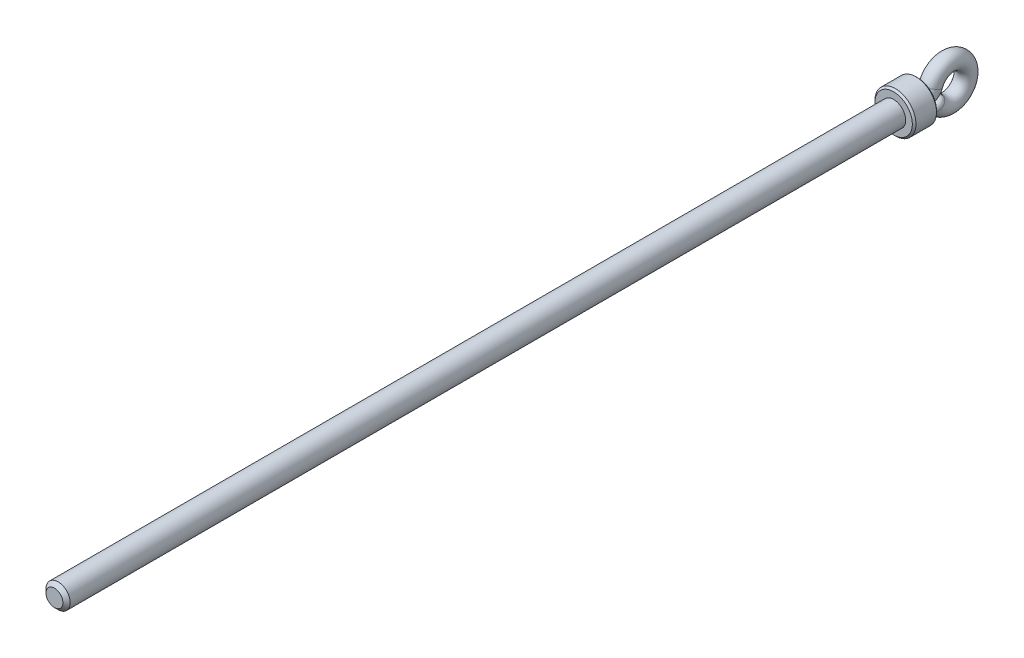
ISO-10303-21;
HEADER;
FILE_DESCRIPTION(('STEP AP214'),'2;1');
FILE_NAME('part.step','',(''),(''),'','','');
FILE_SCHEMA(('AUTOMOTIVE_DESIGN { 1 0 10303 214 1 1 1 1 }'));
ENDSEC;
DATA;
#1=APPLICATION_CONTEXT('core data for automotive mechanical design processes');
#2=APPLICATION_PROTOCOL_DEFINITION('international standard','automotive_design',2000,#1);
#3=PRODUCT_CONTEXT('',#1,'mechanical');
#4=PRODUCT('Part','Part','',(#3));
#5=PRODUCT_RELATED_PRODUCT_CATEGORY('part','',(#4));
#6=PRODUCT_DEFINITION_FORMATION('','',#4);
#7=PRODUCT_DEFINITION_CONTEXT('part definition',#1,'design');
#8=PRODUCT_DEFINITION('design','',#6,#7);
#9=PRODUCT_DEFINITION_SHAPE('','',#8);
#10=(LENGTH_UNIT() NAMED_UNIT(*) SI_UNIT(.MILLI.,.METRE.));
#11=(NAMED_UNIT(*) PLANE_ANGLE_UNIT() SI_UNIT($,.RADIAN.));
#12=(NAMED_UNIT(*) SI_UNIT($,.STERADIAN.) SOLID_ANGLE_UNIT());
#13=UNCERTAINTY_MEASURE_WITH_UNIT(LENGTH_MEASURE(1.E-05),#10,'distance_accuracy_value','');
#14=(GEOMETRIC_REPRESENTATION_CONTEXT(3) GLOBAL_UNCERTAINTY_ASSIGNED_CONTEXT((#13)) GLOBAL_UNIT_ASSIGNED_CONTEXT((#10,
#11,#12)) REPRESENTATION_CONTEXT('',''));
#15=CARTESIAN_POINT('',(0.,0.,0.));
#16=DIRECTION('',(0.,0.,1.));
#17=DIRECTION('',(1.,0.,0.));
#18=AXIS2_PLACEMENT_3D('',#15,#16,#17);
#19=CARTESIAN_POINT('',(0.,0.,695.));
#20=DIRECTION('',(0.,0.,-1.));
#21=DIRECTION('',(-1.,0.,0.));
#22=AXIS2_PLACEMENT_3D('',#19,#20,#21);
#23=CYLINDRICAL_SURFACE('',#22,10.);
#24=CARTESIAN_POINT('',(0.,0.,692.));
#25=DIRECTION('',(0.,0.,1.));
#26=DIRECTION('',(1.,0.,0.));
#27=AXIS2_PLACEMENT_3D('',#24,#25,#26);
#28=CIRCLE('',#27,10.);
#29=CARTESIAN_POINT('',(10.,0.,692.));
#30=VERTEX_POINT('',#29);
#31=EDGE_CURVE('E33',#30,#30,#28,.F.);
#32=ORIENTED_EDGE('',*,*,#31,.T.);
#33=EDGE_LOOP('',(#32));
#34=FACE_BOUND('',#33,.T.);
#35=CARTESIAN_POINT('',(0.,0.,0.));
#36=DIRECTION('',(0.,0.,1.));
#37=DIRECTION('',(1.,0.,0.));
#38=AXIS2_PLACEMENT_3D('',#35,#36,#37);
#39=CIRCLE('',#38,10.);
#40=CARTESIAN_POINT('',(10.,0.,0.));
#41=VERTEX_POINT('',#40);
#42=EDGE_CURVE('E142',#41,#41,#39,.T.);
#43=ORIENTED_EDGE('',*,*,#42,.T.);
#44=EDGE_LOOP('',(#43));
#45=FACE_BOUND('',#44,.T.);
#46=ADVANCED_FACE('F14',(#34,#45),#23,.T.);
#47=CARTESIAN_POINT('',(0.,0.,695.));
#48=DIRECTION('',(0.,0.,1.));
#49=DIRECTION('',(1.,0.,0.));
#50=AXIS2_PLACEMENT_3D('',#47,#48,#49);
#51=PLANE('',#50);
#52=CARTESIAN_POINT('',(0.,0.,695.));
#53=DIRECTION('',(0.,0.,1.));
#54=DIRECTION('',(1.,0.,0.));
#55=AXIS2_PLACEMENT_3D('',#52,#53,#54);
#56=CIRCLE('',#55,7.00000000000001);
#57=CARTESIAN_POINT('',(7.00000000000001,0.,695.));
#58=VERTEX_POINT('',#57);
#59=EDGE_CURVE('E113',#58,#58,#56,.T.);
#60=ORIENTED_EDGE('',*,*,#59,.T.);
#61=EDGE_LOOP('',(#60));
#62=FACE_BOUND('',#61,.T.);
#63=ADVANCED_FACE('F82',(#62),#51,.T.);
#64=CARTESIAN_POINT('',(0.,0.,-20.));
#65=DIRECTION('',(0.,0.,1.));
#66=DIRECTION('',(1.,0.,0.));
#67=AXIS2_PLACEMENT_3D('',#64,#65,#66);
#68=CYLINDRICAL_SURFACE('',#67,17.);
#69=CARTESIAN_POINT('',(0.,0.,-1.49999999999995));
#70=DIRECTION('',(0.,0.,1.));
#71=DIRECTION('',(1.,0.,0.));
#72=AXIS2_PLACEMENT_3D('',#69,#70,#71);
#73=CIRCLE('',#72,17.);
#74=CARTESIAN_POINT('',(17.,0.,-1.49999999999995));
#75=VERTEX_POINT('',#74);
#76=EDGE_CURVE('E130',#75,#75,#73,.F.);
#77=ORIENTED_EDGE('',*,*,#76,.T.);
#78=EDGE_LOOP('',(#77));
#79=FACE_BOUND('',#78,.T.);
#80=CARTESIAN_POINT('',(0.,0.,-18.5000000000001));
#81=DIRECTION('',(0.,0.,1.));
#82=DIRECTION('',(1.,0.,0.));
#83=AXIS2_PLACEMENT_3D('',#80,#81,#82);
#84=CIRCLE('',#83,17.);
#85=CARTESIAN_POINT('',(17.,0.,-18.5000000000001));
#86=VERTEX_POINT('',#85);
#87=EDGE_CURVE('E134',#86,#86,#84,.T.);
#88=ORIENTED_EDGE('',*,*,#87,.T.);
#89=EDGE_LOOP('',(#88));
#90=FACE_BOUND('',#89,.T.);
#91=ADVANCED_FACE('F88',(#79,#90),#68,.T.);
#92=CARTESIAN_POINT('',(0.,0.,-20.));
#93=DIRECTION('',(0.,0.,1.));
#94=DIRECTION('',(1.,0.,0.));
#95=AXIS2_PLACEMENT_3D('',#92,#93,#94);
#96=PLANE('',#95);
#97=CARTESIAN_POINT('',(0.,0.,-20.));
#98=DIRECTION('',(0.,0.,1.));
#99=DIRECTION('',(1.,0.,0.));
#100=AXIS2_PLACEMENT_3D('',#97,#98,#99);
#101=CIRCLE('',#100,9.);
#102=CARTESIAN_POINT('',(9.,0.,-20.));
#103=VERTEX_POINT('',#102);
#104=EDGE_CURVE('E120',#103,#103,#101,.T.);
#105=ORIENTED_EDGE('',*,*,#104,.T.);
#106=EDGE_LOOP('',(#105));
#107=FACE_BOUND('',#106,.T.);
#108=CARTESIAN_POINT('',(0.,0.,-20.));
#109=DIRECTION('',(0.,0.,1.));
#110=DIRECTION('',(1.,0.,0.));
#111=AXIS2_PLACEMENT_3D('',#108,#109,#110);
#112=CIRCLE('',#111,15.5);
#113=CARTESIAN_POINT('',(15.5,0.,-20.));
#114=VERTEX_POINT('',#113);
#115=EDGE_CURVE('E126',#114,#114,#112,.F.);
#116=ORIENTED_EDGE('',*,*,#115,.T.);
#117=EDGE_LOOP('',(#116));
#118=FACE_BOUND('',#117,.T.);
#119=ADVANCED_FACE('F271',(#107,#118),#96,.F.);
#120=CARTESIAN_POINT('',(0.,0.,0.));
#121=DIRECTION('',(0.,0.,1.));
#122=DIRECTION('',(1.,0.,0.));
#123=AXIS2_PLACEMENT_3D('',#120,#121,#122);
#124=PLANE('',#123);
#125=CARTESIAN_POINT('',(0.,0.,0.));
#126=DIRECTION('',(0.,0.,1.));
#127=DIRECTION('',(1.,0.,0.));
#128=AXIS2_PLACEMENT_3D('',#125,#126,#127);
#129=CIRCLE('',#128,15.5000000000002);
#130=CARTESIAN_POINT('',(15.5000000000002,0.,0.));
#131=VERTEX_POINT('',#130);
#132=EDGE_CURVE('E138',#131,#131,#129,.T.);
#133=ORIENTED_EDGE('',*,*,#132,.T.);
#134=EDGE_LOOP('',(#133));
#135=FACE_BOUND('',#134,.T.);
#136=ORIENTED_EDGE('',*,*,#42,.F.);
#137=EDGE_LOOP('',(#136));
#138=FACE_BOUND('',#137,.T.);
#139=ADVANCED_FACE('F67',(#135,#138),#124,.T.);
#140=CARTESIAN_POINT('',(0.,-5.6190989012386,-31.0922421814982));
#141=DIRECTION('',(0.,-0.92718385456679,-0.374606593415906));
#142=DIRECTION('',(0.,0.374606593415906,-0.92718385456679));
#143=AXIS2_PLACEMENT_3D('',#140,#141,#142);
#144=PLANE('',#143);
#145=CARTESIAN_POINT('',(-0.267814899753251,-4.24294874486969,-34.4983333418537));
#146=CARTESIAN_POINT('',(-0.535964039163629,-3.18618303783898,-37.1139202504667));
#147=CARTESIAN_POINT('',(-0.624901432757596,-5.31433814850181,-38.9828767941055));
#148=CARTESIAN_POINT('',(-0.10669981189394,-4.23721080551919,-34.5125352401058));
#149=CARTESIAN_POINT('',(-0.213372702047782,-3.17709115436088,-37.1364234517361));
#150=CARTESIAN_POINT('',(-0.24896622772436,-5.29458411469505,-39.010392555168));
#151=CARTESIAN_POINT('',(0.0557192743773867,-4.23666309919185,-34.5138908608362));
#152=CARTESIAN_POINT('',(0.111416626490471,-3.17622472220716,-37.1385679465691));
#153=CARTESIAN_POINT('',(0.130011640243449,-5.29269527178391,-39.0130149226404));
#154=CARTESIAN_POINT('',(0.378406067436832,-4.2459646647267,-34.4908686782647));
#155=CARTESIAN_POINT('',(0.75758345158823,-3.1909667929823,-37.1020800410015));
#156=CARTESIAN_POINT('',(0.882947490699488,-5.32472333482806,-38.9684170545828));
#157=CARTESIAN_POINT('',(0.538674013800429,-4.25581276889777,-34.4664937650998));
#158=CARTESIAN_POINT('',(1.07983936736787,-3.20661368418201,-37.0633526262963));
#159=CARTESIAN_POINT('',(1.25690603219717,-5.35863621941736,-38.9212024169067));
#160=CARTESIAN_POINT('',(0.850088972014333,-4.28527806984585,-34.3935645860912));
#161=CARTESIAN_POINT('',(1.71070497526709,-3.25374810830347,-36.9466908328098));
#162=CARTESIAN_POINT('',(1.98354093470394,-5.45975590992779,-38.7795031073018));
#163=CARTESIAN_POINT('',(1.00133655074529,-4.30474694972162,-34.34537741746));
#164=CARTESIAN_POINT('',(2.02022082468757,-3.28511609734602,-36.8690523355125));
#165=CARTESIAN_POINT('',(2.33645195176725,-5.52645716066193,-38.6857360033921));
#166=CARTESIAN_POINT('',(1.29332499429876,-4.35265493436786,-34.2268009944884));
#167=CARTESIAN_POINT('',(2.62575498343679,-3.36316682901066,-36.6758699956699));
#168=CARTESIAN_POINT('',(3.0177583200599,-5.68980738952441,-38.4540301378224));
#169=CARTESIAN_POINT('',(1.43406464981001,-4.3810950696393,-34.1564091895687));
#170=CARTESIAN_POINT('',(2.92236085455471,-3.41003385837555,-36.5598700274302));
#171=CARTESIAN_POINT('',(3.34615084956294,-5.78645980803033,-38.3160863016868));
#172=CARTESIAN_POINT('',(1.70559193340705,-4.44694228423316,-33.9934316143933));
#173=CARTESIAN_POINT('',(3.50581556944884,-3.52019578102394,-36.2872097009361));
#174=CARTESIAN_POINT('',(3.97971451127664,-6.00891158281849,-37.9950991149901));
#175=CARTESIAN_POINT('',(1.8359668712502,-4.48458778863466,-33.900255721359));
#176=CARTESIAN_POINT('',(3.79246172010584,-3.58416094446185,-36.1288903658342));
#177=CARTESIAN_POINT('',(4.28392269958881,-6.13548232047446,-37.8108522184167));
#178=CARTESIAN_POINT('',(2.07903816647017,-4.56717462556752,-33.6958461270012));
#179=CARTESIAN_POINT('',(4.34129872883696,-3.72715987201687,-35.7749556001902));
#180=CARTESIAN_POINT('',(4.85108905510651,-6.41121009640481,-37.4043532677781));
#181=CARTESIAN_POINT('',(2.19173041569785,-4.61211764858216,-33.5846082415849));
#182=CARTESIAN_POINT('',(4.60364524530678,-3.80646547441348,-35.5786673462961));
#183=CARTESIAN_POINT('',(5.1140376366307,-6.56037236750889,-37.182092407072));
#184=CARTESIAN_POINT('',(2.40231481600309,-4.71048518827116,-33.3411400372977));
#185=CARTESIAN_POINT('',(5.11142479367259,-3.98388725587503,-35.1395330274909));
#186=CARTESIAN_POINT('',(5.60540123733802,-6.88438053582401,-36.6927903523807));
#187=CARTESIAN_POINT('',(2.49915407592637,-4.76422609928737,-33.2081266149509));
#188=CARTESIAN_POINT('',(5.35503971113456,-4.08300472606897,-34.89420868007));
#189=CARTESIAN_POINT('',(5.83135951049494,-7.06015030018002,-36.4240392911957));
#190=CARTESIAN_POINT('',(2.6685229621291,-4.87683900319797,-32.9293998969567));
#191=CARTESIAN_POINT('',(5.8029016387366,-4.29594611758227,-34.3671602413872));
#192=CARTESIAN_POINT('',(6.22655357830282,-7.42544617922704,-35.857502136448));
#193=CARTESIAN_POINT('',(2.74104712599448,-4.935712145316,-32.7836837568811));
#194=CARTESIAN_POINT('',(6.00674674067439,-4.41005227440125,-34.0847375927508));
#195=CARTESIAN_POINT('',(6.39577662732095,-7.61497537337142,-35.5597095380411));
#196=CARTESIAN_POINT('',(2.86267410632611,-5.05958707808983,-32.4770825393047));
#197=CARTESIAN_POINT('',(6.37581947811972,-4.65663337946306,-33.4744279413114));
#198=CARTESIAN_POINT('',(6.67957291476036,-8.01050509923215,-34.9296020277957));
#199=CARTESIAN_POINT('',(2.91066484290466,-5.12474243781629,-32.3158173650161));
#200=CARTESIAN_POINT('',(6.53823980201785,-4.7898488931911,-33.1447079746119));
#201=CARTESIAN_POINT('',(6.79155130011042,-8.2168631059956,-34.5963623398276));
#202=CARTESIAN_POINT('',(2.97723912694888,-5.2571327776788,-31.9881397753031));
#203=CARTESIAN_POINT('',(6.80459024537531,-5.06828018911193,-32.4555663344986));
#204=CARTESIAN_POINT('',(6.94689129621408,-8.6327300545619,-33.9156505539856));
#205=CARTESIAN_POINT('',(2.99581930203228,-5.32436799540214,-31.8217267718295));
#206=CARTESIAN_POINT('',(6.90756393001704,-5.21365603767943,-32.0957484829051));
#207=CARTESIAN_POINT('',(6.99024503807571,-8.84223935492987,-33.5681768286418));
#208=CARTESIAN_POINT('',(3.00297095485652,-5.46003619821918,-31.4859361866104));
#209=CARTESIAN_POINT('',(7.04792453219719,-5.51541300187756,-31.3488737878915));
#210=CARTESIAN_POINT('',(7.00693222799816,-9.2617574972421,-32.863758346261));
#211=CARTESIAN_POINT('',(2.99110810652139,-5.52847252902018,-31.3165503239488));
#212=CARTESIAN_POINT('',(7.08320525408174,-5.67193252423053,-30.9614743758125));
#213=CARTESIAN_POINT('',(6.97925224854835,-9.47173038745556,-32.5067492305341));
#214=CARTESIAN_POINT('',(2.93647501381529,-5.66359719160117,-30.9821050480223));
#215=CARTESIAN_POINT('',(7.07764622811232,-5.98967234228318,-30.1750407293435));
#216=CARTESIAN_POINT('',(6.85177503223625,-9.88339870069763,-31.7989770209835));
#217=CARTESIAN_POINT('',(2.89370596052631,-5.73028559064137,-30.8170454682825));
#218=CARTESIAN_POINT('',(7.03563962131795,-6.15079719396175,-29.7762427271952));
#219=CARTESIAN_POINT('',(6.75198057456524,-10.0850944423994,-31.44821368699));
#220=CARTESIAN_POINT('',(2.77884994105621,-5.85907311491569,-30.4982851600671));
#221=CARTESIAN_POINT('',(6.87093161465208,-6.47018696868093,-28.9857252946722));
#222=CARTESIAN_POINT('',(6.483983195794,-10.4721971890889,-30.7685131820488));
#223=CARTESIAN_POINT('',(2.70714713847289,-5.92122023517829,-30.3444656397274));
#224=CARTESIAN_POINT('',(6.74822619668567,-6.62826029452503,-28.5944800839996));
#225=CARTESIAN_POINT('',(6.31667665642216,-10.6577803335356,-30.4393533096008));
#226=CARTESIAN_POINT('',(2.53613119994427,-6.03993497912505,-30.0506363376781));
#227=CARTESIAN_POINT('',(6.42064236153453,-6.93744162777071,-27.8292294307615));
#228=CARTESIAN_POINT('',(5.9176394665236,-11.0104370540509,-29.8088517089643));
#229=CARTESIAN_POINT('',(2.43682318052268,-6.09650363412717,-29.9106240033669));
#230=CARTESIAN_POINT('',(6.21498311331832,-7.08820123680677,-27.4560863044102));
#231=CARTESIAN_POINT('',(5.68592075455222,-11.177514052147,-29.5075048395134));
#232=CARTESIAN_POINT('',(2.21636936017603,-6.2007470634353,-29.6526124619314));
#233=CARTESIAN_POINT('',(5.73013766037578,-7.37181670926837,-26.7541133770951));
#234=CARTESIAN_POINT('',(5.17152850707809,-11.4840832244933,-28.9509792022461));
#235=CARTESIAN_POINT('',(2.09591453127465,-6.24862686251161,-29.5341058006934));
#236=CARTESIAN_POINT('',(5.45269078156246,-7.50469196855701,-26.4252355696854));
#237=CARTESIAN_POINT('',(4.89046723963124,-11.624217886761,-28.6947422138669));
#238=CARTESIAN_POINT('',(1.83464081316523,-6.33585912965116,-29.3181983631026));
#239=CARTESIAN_POINT('',(4.82763579395748,-7.75093360432913,-25.8157661342221));
#240=CARTESIAN_POINT('',(4.28082856405543,-11.8786970961703,-28.22715060489));
#241=CARTESIAN_POINT('',(1.69382006872958,-6.37521082003178,-29.2207995115818));
#242=CARTESIAN_POINT('',(4.48000858770836,-7.86386505816323,-25.5362509775002));
#243=CARTESIAN_POINT('',(3.95224682706205,-11.9930392913223,-28.0158000775468));
#244=CARTESIAN_POINT('',(1.40028972794923,-6.44305189842871,-29.05288695032));
#245=CARTESIAN_POINT('',(3.73660921746577,-8.0611549293417,-25.0479414110342));
#246=CARTESIAN_POINT('',(3.2673426985226,-12.1896978973501,-27.6510240868038));
#247=CARTESIAN_POINT('',(1.24804435611005,-6.47182363348289,-28.9816744071374));
#248=CARTESIAN_POINT('',(3.34282932990734,-8.1458893792419,-24.8382162880546));
#249=CARTESIAN_POINT('',(2.91210349749226,-12.2728481817796,-27.496094226833));
#250=CARTESIAN_POINT('',(0.932747091781649,-6.51910388164867,-28.864651686476));
#251=CARTESIAN_POINT('',(2.51384420994787,-8.28641586853571,-24.4904010218468));
#252=CARTESIAN_POINT('',(2.17640988072989,-12.4092924860004,-27.2413266673811));
#253=CARTESIAN_POINT('',(0.769710861092856,-6.53762691917468,-28.81880555981));
#254=CARTESIAN_POINT('',(2.07939645923682,-8.34195358605524,-24.3529403473455));
#255=CARTESIAN_POINT('',(1.79599200919864,-12.4626287592013,-27.1414110029766));
#256=CARTESIAN_POINT('',(0.504559541538937,-6.55856746018863,-28.766975902043));
#257=CARTESIAN_POINT('',(1.36676595853375,-8.40503161707914,-24.1968167420188));
#258=CARTESIAN_POINT('',(1.17730559693496,-12.5228887941041,-27.0284221432915));
#259=CARTESIAN_POINT('',(0.404312496262393,-6.5644661816725,-28.7523760540463));
#260=CARTESIAN_POINT('',(1.09603956052915,-8.42286039325096,-24.1526889725034));
#261=CARTESIAN_POINT('',(0.9433958246131,-12.5398515840755,-26.9965840252859));
#262=CARTESIAN_POINT('',(0.202725883288975,-6.57234286012485,-28.7328805907603));
#263=CARTESIAN_POINT('',(0.550143007606992,-8.44670511194332,-24.0936712227445));
#264=CARTESIAN_POINT('',(0.473027060999225,-12.5624983513959,-26.9540664581324));
#265=CARTESIAN_POINT('',(0.101386327901199,-6.57432086122103,-28.7279848662511));
#266=CARTESIAN_POINT('',(0.275190979382255,-8.45270188381369,-24.0788286915253));
#267=CARTESIAN_POINT('',(0.236568098428444,-12.5681824556865,-26.9433867708464));
#268=CARTESIAN_POINT('',(-0.165237092147791,-6.57431605344368,-28.7279967659176));
#269=CARTESIAN_POINT('',(-0.448499740087207,-8.45268614664155,-24.0788676423932));
#270=CARTESIAN_POINT('',(-0.385553214998983,-12.5681698511401,-26.9434137921355));
#271=CARTESIAN_POINT('',(-0.330598420166323,-6.56905430543396,-28.7410200492424));
#272=CARTESIAN_POINT('',(-0.896849121504695,-8.43673745589875,-24.1183420371798));
#273=CARTESIAN_POINT('',(-0.771396313677786,-12.5530513462082,-26.9718249240442));
#274=CARTESIAN_POINT('',(-0.656720245210439,-6.5481568360175,-28.7927431010648));
#275=CARTESIAN_POINT('',(-1.77657720646737,-8.37363171091723,-24.2745342369586));
#276=CARTESIAN_POINT('',(-1.5323472387816,-12.4929374464877,-27.0846009430529));
#277=CARTESIAN_POINT('',(-0.817474803317348,-6.53250830110106,-28.8314745841117));
#278=CARTESIAN_POINT('',(-2.20702699852984,-8.32657126632454,-24.391012924686));
#279=CARTESIAN_POINT('',(-1.90744120772978,-12.447905148927,-27.1690349419063));
#280=CARTESIAN_POINT('',(-1.1295537145794,-6.4913478415649,-28.9333502963902));
#281=CARTESIAN_POINT('',(-3.03315971448818,-8.20372522900593,-24.6950675366476));
#282=CARTESIAN_POINT('',(-2.63562533402929,-12.329222364088,-27.3909154754928));
#283=CARTESIAN_POINT('',(-1.2808868248304,-6.46584524001853,-28.9964714502056));
#284=CARTESIAN_POINT('',(-3.42815911377845,-8.12821704941378,-24.8819568392814));
#285=CARTESIAN_POINT('',(-2.98873592460433,-12.2555989269648,-27.5283119014236));
#286=CARTESIAN_POINT('',(-1.57007644312573,-6.40577953460372,-29.1451392880189));
#287=CARTESIAN_POINT('',(-4.16927867998275,-7.95235857172891,-25.3172218454611));
#288=CARTESIAN_POINT('',(-3.6635117006229,-12.0817197266258,-27.8514948458113));
#289=CARTESIAN_POINT('',(-1.70793593426103,-6.37121844257366,-29.2306809925423));
#290=CARTESIAN_POINT('',(-4.51497923938364,-7.85234276624688,-25.5647696507435));
#291=CARTESIAN_POINT('',(-3.985183846612,-11.9814698769164,-28.0372706194359));
#292=CARTESIAN_POINT('',(-1.967863123793,-6.29370238387418,-29.422539970358));
#293=CARTESIAN_POINT('',(-5.14972343050821,-7.63126996421923,-26.1119440366901));
#294=CARTESIAN_POINT('',(-4.59168062218068,-11.7558350754682,-28.453232261639));
#295=CARTESIAN_POINT('',(-2.08976377541197,-6.25066887428398,-29.529051644201));
#296=CARTESIAN_POINT('',(-5.43810290132604,-7.51038127971641,-26.4111540304297));
#297=CARTESIAN_POINT('',(-4.8761154759454,-11.6302146221968,-28.6838334054978));
#298=CARTESIAN_POINT('',(-2.31309727203604,-6.15770426512614,-29.7591471261606));
#299=CARTESIAN_POINT('',(-5.94668038335633,-7.25381463730369,-27.0461787540907));
#300=CARTESIAN_POINT('',(-5.39722696806792,-11.3576735593833,-29.1809325311169));
#301=CARTESIAN_POINT('',(-2.41452738539323,-6.1077722464971,-29.8827332090339));
#302=CARTESIAN_POINT('',(-6.16710259168332,-7.11849846276234,-27.3810980387527));
#303=CARTESIAN_POINT('',(-5.63389723258058,-11.2107501115972,-29.4474352957918));
#304=CARTESIAN_POINT('',(-2.5966803852752,-6.00116740182763,-30.1465894585858));
#305=CARTESIAN_POINT('',(-6.54073421000398,-6.83544924507487,-28.0816694363207));
#306=CARTESIAN_POINT('',(-6.0589208989792,-10.8954931546131,-30.0149538201397));
#307=CARTESIAN_POINT('',(-2.67684921633415,-5.94436178532914,-30.2871882931814));
#308=CARTESIAN_POINT('',(-6.69281576102581,-6.68778972125284,-28.4471395825142));
#309=CARTESIAN_POINT('',(-6.24598150477781,-10.7267311856226,-30.3166432456418));
#310=CARTESIAN_POINT('',(-2.81141791503929,-5.82662073790982,-30.5786076117564));
#311=CARTESIAN_POINT('',(-6.92206836095539,-6.38870384901207,-29.1874030929399));
#312=CARTESIAN_POINT('',(-6.55997513508736,-10.3748867902622,-30.9400082050123));
#313=CARTESIAN_POINT('',(-2.86581410690899,-5.76568471931359,-30.7294295502835));
#314=CARTESIAN_POINT('',(-7.00002752535391,-6.23752461902532,-29.5615848175898));
#315=CARTESIAN_POINT('',(-6.6868995827865,-10.1918023255077,-31.2616865823731));
#316=CARTESIAN_POINT('',(-2.94897598749161,-5.639498571864,-31.0417512249192));
#317=CARTESIAN_POINT('',(-7.08546210507058,-5.93216835664194,-30.3173680882232));
#318=CARTESIAN_POINT('',(-6.88094397081496,-9.81020111189018,-31.9254171033894));
#319=CARTESIAN_POINT('',(-2.97693941011896,-5.5741742356464,-31.2034346306996));
#320=CARTESIAN_POINT('',(-7.09181436223382,-5.77812321895293,-30.6986431833499));
#321=CARTESIAN_POINT('',(-6.94619195694449,-9.61138862839213,-32.2677902753251));
#322=CARTESIAN_POINT('',(-3.00400264473196,-5.44269169305799,-31.5288653433139));
#323=CARTESIAN_POINT('',(-7.0344080491124,-5.47620956196366,-31.445905706631));
#324=CARTESIAN_POINT('',(-7.00933950437414,-9.20830719904835,-32.9539945343634));
#325=CARTESIAN_POINT('',(-3.00309807278968,-5.37653336156058,-31.6926129598471));
#326=CARTESIAN_POINT('',(-6.97169088091768,-5.32837189857584,-31.811816763722));
#327=CARTESIAN_POINT('',(-7.0072288365091,-9.00403742915886,-33.297825834972));
#328=CARTESIAN_POINT('',(-2.97226379285404,-5.2434339065651,-32.0220456711033));
#329=CARTESIAN_POINT('',(-6.7810942466621,-5.0389682080142,-32.5281160335613));
#330=CARTESIAN_POINT('',(-6.93528218332624,-8.58990410920832,-33.9862929927512));
#331=CARTESIAN_POINT('',(-2.94157953478853,-5.17651720011601,-32.1876703315093));
#332=CARTESIAN_POINT('',(-6.65256825978373,-4.89751561236648,-32.8782234934305));
#333=CARTESIAN_POINT('',(-6.86368558117342,-8.38003329544211,-34.3307170389853));
#334=CARTESIAN_POINT('',(-2.85096997132787,-5.04551528630781,-32.5119114461484));
#335=CARTESIAN_POINT('',(-6.33809144934531,-4.62815335371664,-33.5449184786212));
#336=CARTESIAN_POINT('',(-6.65226326643107,-7.9658134137187,-35.0014299241157));
#337=CARTESIAN_POINT('',(-2.791041290668,-4.9814304067172,-32.6705270891259));
#338=CARTESIAN_POINT('',(-6.15301224015491,-4.50004187549883,-33.8620055141299));
#339=CARTESIAN_POINT('',(-6.51242967822388,-7.76146498600525,-35.3277166648395));
#340=CARTESIAN_POINT('',(-2.64271969312055,-4.85730369762863,-32.9777514749489));
#341=CARTESIAN_POINT('',(-5.73212439282308,-4.25846022465411,-34.4599410821623));
#342=CARTESIAN_POINT('',(-6.1663459506161,-7.36243913289173,-35.9561759020384));
#343=CARTESIAN_POINT('',(-2.55405610709969,-4.79730715510843,-33.126248128591));
#344=CARTESIAN_POINT('',(-5.49644403070212,-4.14483256782397,-34.741179401767));
#345=CARTESIAN_POINT('',(-5.95946424990454,-7.1678748456207,-36.2580835617053));
#346=CARTESIAN_POINT('',(-2.35060582109398,-4.6838755068201,-33.4070013100308));
#347=CARTESIAN_POINT('',(-4.98400245652423,-3.93533758283828,-35.2596976849618));
#348=CARTESIAN_POINT('',(-5.48474691588556,-6.79714752840173,-36.8256230192003));
#349=CARTESIAN_POINT('',(-2.2358201549264,-4.63044014151316,-33.5392584802095));
#350=CARTESIAN_POINT('',(-4.70754737699064,-3.83911799344867,-35.4978495257012));
#351=CARTESIAN_POINT('',(-5.21691369481845,-6.62098377062994,-37.0912562519731));
#352=CARTESIAN_POINT('',(-1.98546547851585,-4.53286402953773,-33.7807678321674));
#353=CARTESIAN_POINT('',(-4.12730577403505,-3.66728339495908,-35.9231550813848));
#354=CARTESIAN_POINT('',(-4.63275278321325,-6.29704641647726,-37.5736856392028));
#355=CARTESIAN_POINT('',(-1.85033996382722,-4.48856390973796,-33.8904144762886));
#356=CARTESIAN_POINT('',(-3.82414878836826,-3.59097237799392,-36.1120314762461));
#357=CARTESIAN_POINT('',(-4.31745991563456,-6.14879083423836,-37.7913248227227));
#358=CARTESIAN_POINT('',(-1.5613123139203,-4.40959814038689,-34.0858616138793));
#359=CARTESIAN_POINT('',(-3.19357721503409,-3.45742146293026,-36.4425815903819));
#360=CARTESIAN_POINT('',(-3.643062065839,-5.88302968473247,-38.1774757460196));
#361=CARTESIAN_POINT('',(-1.40741605342387,-4.37492948753143,-34.1716695407875));
#362=CARTESIAN_POINT('',(-2.86574251873184,-3.39984359530072,-36.5850918135995));
#363=CARTESIAN_POINT('',(-3.28397079130649,-5.76551453258944,-38.3460028008478));
#364=CARTESIAN_POINT('',(-1.09303354582871,-4.31802970787059,-34.3125014373883));
#365=CARTESIAN_POINT('',(-2.20906449564348,-3.30662991005437,-36.8158037805113));
#366=CARTESIAN_POINT('',(-2.55041160694879,-5.57187099924453,-38.6216468005123));
#367=CARTESIAN_POINT('',(-0.933210394927678,-4.29528479570716,-34.3687970704662));
#368=CARTESIAN_POINT('',(-1.88044231306173,-3.26985154109046,-36.9068334380239));
#369=CARTESIAN_POINT('',(-2.17749092157962,-5.49403784440166,-38.7313065637311));
#370=CARTESIAN_POINT('',(-0.605342130105587,-4.26076431514311,-34.4542382580838));
#371=CARTESIAN_POINT('',(-1.21427168553867,-3.21450025580672,-37.0438326765494));
#372=CARTESIAN_POINT('',(-1.41246497033531,-5.37566830736178,-38.8974393176044));
#373=CARTESIAN_POINT('',(-0.437300017329104,-4.24898477376296,-34.4833936460931));
#374=CARTESIAN_POINT('',(-0.875838035914701,-3.19576201414789,-37.0902114521353));
#375=CARTESIAN_POINT('',(-1.0203667071309,-5.33511841673627,-38.9539315720234));
#376=CARTESIAN_POINT('',(-0.267814899753251,-4.24294874486969,-34.4983333418537));
#377=CARTESIAN_POINT('',(-0.535964039163629,-3.18618303783898,-37.1139202504667));
#378=CARTESIAN_POINT('',(-0.624901432757596,-5.31433814850181,-38.9828767941055));
#379=(BOUNDED_SURFACE() B_SPLINE_SURFACE(3,2,((#145,#146,#147),(#148,#149,#150),(#151,#152,
#153),(#154,#155,#156),(#157,#158,#159),(#160,#161,#162),(#163,#164,#165),(#166,#167,#168),
(#169,#170,#171),(#172,#173,#174),(#175,#176,#177),(#178,#179,#180),(#181,#182,#183),(#184,#185,
#186),(#187,#188,#189),(#190,#191,#192),(#193,#194,#195),(#196,#197,#198),(#199,#200,#201),
(#202,#203,#204),(#205,#206,#207),(#208,#209,#210),(#211,#212,#213),(#214,#215,#216),(#217,#218,
#219),(#220,#221,#222),(#223,#224,#225),(#226,#227,#228),(#229,#230,#231),(#232,#233,#234),
(#235,#236,#237),(#238,#239,#240),(#241,#242,#243),(#244,#245,#246),(#247,#248,#249),(#250,#251,
#252),(#253,#254,#255),(#256,#257,#258),(#259,#260,#261),(#262,#263,#264),(#265,#266,#267),
(#268,#269,#270),(#271,#272,#273),(#274,#275,#276),(#277,#278,#279),(#280,#281,#282),(#283,#284,
#285),(#286,#287,#288),(#289,#290,#291),(#292,#293,#294),(#295,#296,#297),(#298,#299,#300),
(#301,#302,#303),(#304,#305,#306),(#307,#308,#309),(#310,#311,#312),(#313,#314,#315),(#316,#317,
#318),(#319,#320,#321),(#322,#323,#324),(#325,#326,#327),(#328,#329,#330),(#331,#332,#333),
(#334,#335,#336),(#337,#338,#339),(#340,#341,#342),(#343,#344,#345),(#346,#347,#348),(#349,#350,
#351),(#352,#353,#354),(#355,#356,#357),(#358,#359,#360),(#361,#362,#363),(#364,#365,#366),
(#367,#368,#369),(#370,#371,#372),(#373,#374,#375),(#376,#377,#378)),.UNSPECIFIED.,.T.,.F.,
.F.) B_SPLINE_SURFACE_WITH_KNOTS((4,2,2,2,2,2,2,2,2,2,2,2,2,2,2,2,2,2,2,2,2,2,2,2,2,2,2,2,2,2,2,
2,2,2,2,2,2,2,4),(3,3),(0.,0.484906264846502,0.969758069245291,1.44735806827545,
1.92501294776246,2.41667025983676,2.90844162812504,3.42538627880343,3.94244698399304,
4.48123213406685,5.02007905983654,5.56665623703478,6.11321235103519,6.65273863742296,
7.192164991231,7.71645479841437,8.24079239575513,8.74989761023979,9.25827946256416,
9.56221187526015,9.86614086717984,10.3614773083335,10.8574259526719,11.3529065173159,
11.8482771316999,12.3484768464242,12.8487432651774,13.3609898282839,13.8733094276628,
14.400721633121,14.928213932404,15.4694302791303,16.0107091054845,16.5572423955035,
17.1037540594757,17.63972627449,18.17553117346,18.6858135803125,19.1959110293021),(0.,1.),
.UNSPECIFIED.) GEOMETRIC_REPRESENTATION_ITEM() RATIONAL_B_SPLINE_SURFACE(((1.,0.815987553315359,
1.),(1.,0.816600922174567,1.),(1.,0.816659702119576,1.),(1.,0.815664998686587,1.),(1.,
0.814611640227577,1.),(1.,0.811484782161348,1.),(1.,0.80942677618711,1.),(1.,0.804418708735595,
1.),(1.,0.801468544780437,1.),(1.,0.794733377815299,1.),(1.,0.790926436806535,1.),(1.,
0.782715109891841,1.),(1.,0.778310585593635,1.),(1.,0.768849524284246,1.),(1.,0.763771152630644,
1.),(1.,0.753351141957017,1.),(1.,0.748009444089199,1.),(1.,0.737010717043996,1.),(1.,
0.731349868744408,1.),(1.,0.720103791794341,1.),(1.,0.714518571888633,1.),(1.,0.703492263754392,
1.),(1.,0.698054392693946,1.),(1.,0.687539448012322,1.),(1.,0.68246236049533,1.),(1.,
0.672842809885072,1.),(1.,0.668294310343447,1.),(1.,0.659749104511278,1.),(1.,0.655752296172079,
1.),(1.,0.648490086234698,1.),(1.,0.645207308076196,1.),(1.,0.639291985461389,1.),(1.,
0.636659500302576,1.),(1.,0.632157919227299,1.),(1.,0.630268867976811,1.),(1.,0.627180167799288,
1.),(1.,0.625979543148585,1.),(1.,0.624625198180391,1.),(1.,0.624244635266044,1.),(1.,
0.623736779399677,1.),(1.,0.623609483597137,1.),(1.,0.623609696254532,1.),(1.,0.623948162467291,
1.),(1.,0.625297953263754,1.),(1.,0.626310108939026,1.),(1.,0.628991015498396,1.),(1.,
0.630659145781884,1.),(1.,0.634625776555858,1.),(1.,0.636924137081079,1.),(1.,0.642141211291449,
1.),(1.,0.645065754045356,1.),(1.,0.651475007803571,1.),(1.,0.654959793456991,1.),(1.,
0.662522518643565,1.),(1.,0.666612664276948,1.),(1.,0.675248765877389,1.),(1.,0.679794786750875,
1.),(1.,0.689397782923427,1.),(1.,0.694465865330274,1.),(1.,0.70488797343684,1.),(1.,
0.710242042443573,1.),(1.,0.721251967379912,1.),(1.,0.72691205082702,1.),(1.,0.738242280753834,
1.),(1.,0.743912428319816,1.),(1.,0.755132062381895,1.),(1.,0.760679843231378,1.),(1.,
0.771378557833266,1.),(1.,0.776529507280024,1.),(1.,0.786098478080735,1.),(1.,0.790528718229196,
1.),(1.,0.798533119306611,1.),(1.,0.802107547048631,1.),(1.,0.808029374078312,1.),(1.,
0.810427111206528,1.),(1.,0.814083377645127,1.),(1.,0.815342319559778,1.),(1.,0.815987553315359,1.))) REPRESENTATION_ITEM('') SURFACE());
#380=CARTESIAN_POINT('',(-0.267814899753251,-4.24294874486969,-34.4983333418537));
#381=CARTESIAN_POINT('',(-0.437300017329104,-4.24898477376296,-34.4833936460931));
#382=CARTESIAN_POINT('',(-0.605342130105587,-4.26076431514311,-34.4542382580838));
#383=CARTESIAN_POINT('',(-0.933210394927678,-4.29528479570716,-34.3687970704662));
#384=CARTESIAN_POINT('',(-1.09303354582871,-4.31802970787059,-34.3125014373883));
#385=CARTESIAN_POINT('',(-1.40741605342387,-4.37492948753143,-34.1716695407875));
#386=CARTESIAN_POINT('',(-1.5613123139203,-4.40959814038689,-34.0858616138793));
#387=CARTESIAN_POINT('',(-1.85033996382722,-4.48856390973796,-33.8904144762886));
#388=CARTESIAN_POINT('',(-1.98546547851585,-4.53286402953773,-33.7807678321674));
#389=CARTESIAN_POINT('',(-2.2358201549264,-4.63044014151316,-33.5392584802095));
#390=CARTESIAN_POINT('',(-2.35060582109398,-4.6838755068201,-33.4070013100308));
#391=CARTESIAN_POINT('',(-2.55405610709969,-4.79730715510843,-33.126248128591));
#392=CARTESIAN_POINT('',(-2.64271969312055,-4.85730369762863,-32.9777514749489));
#393=CARTESIAN_POINT('',(-2.791041290668,-4.9814304067172,-32.6705270891259));
#394=CARTESIAN_POINT('',(-2.85096997132787,-5.04551528630781,-32.5119114461484));
#395=CARTESIAN_POINT('',(-2.94157953478853,-5.17651720011601,-32.1876703315093));
#396=CARTESIAN_POINT('',(-2.97226379285404,-5.2434339065651,-32.0220456711033));
#397=CARTESIAN_POINT('',(-3.00309807278968,-5.37653336156058,-31.6926129598471));
#398=CARTESIAN_POINT('',(-3.00400264473196,-5.44269169305799,-31.5288653433139));
#399=CARTESIAN_POINT('',(-2.97693941011896,-5.5741742356464,-31.2034346306996));
#400=CARTESIAN_POINT('',(-2.94897598749161,-5.639498571864,-31.0417512249192));
#401=CARTESIAN_POINT('',(-2.86581410690899,-5.76568471931359,-30.7294295502835));
#402=CARTESIAN_POINT('',(-2.81141791503929,-5.82662073790982,-30.5786076117564));
#403=CARTESIAN_POINT('',(-2.67684921633415,-5.94436178532914,-30.2871882931814));
#404=CARTESIAN_POINT('',(-2.5966803852752,-6.00116740182763,-30.1465894585858));
#405=CARTESIAN_POINT('',(-2.41452738539323,-6.1077722464971,-29.8827332090339));
#406=CARTESIAN_POINT('',(-2.31309727203604,-6.15770426512614,-29.7591471261606));
#407=CARTESIAN_POINT('',(-2.08976377541197,-6.25066887428398,-29.529051644201));
#408=CARTESIAN_POINT('',(-1.967863123793,-6.29370238387418,-29.422539970358));
#409=CARTESIAN_POINT('',(-1.70793593426103,-6.37121844257366,-29.2306809925423));
#410=CARTESIAN_POINT('',(-1.57007644312574,-6.40577953460372,-29.1451392880189));
#411=CARTESIAN_POINT('',(-1.2808868248304,-6.46584524001853,-28.9964714502056));
#412=CARTESIAN_POINT('',(-1.1295537145794,-6.49134784156489,-28.9333502963902));
#413=CARTESIAN_POINT('',(-0.817474803317348,-6.53250830110106,-28.8314745841117));
#414=CARTESIAN_POINT('',(-0.656720245210439,-6.5481568360175,-28.7927431010648));
#415=CARTESIAN_POINT('',(-0.330598420166324,-6.56905430543396,-28.7410200492424));
#416=CARTESIAN_POINT('',(-0.165237092147791,-6.57431605344368,-28.7279967659176));
#417=CARTESIAN_POINT('',(0.101386327901199,-6.57432086122103,-28.7279848662511));
#418=CARTESIAN_POINT('',(0.202725883288974,-6.57234286012485,-28.7328805907603));
#419=CARTESIAN_POINT('',(0.404312496262393,-6.5644661816725,-28.7523760540463));
#420=CARTESIAN_POINT('',(0.504559541538937,-6.55856746018863,-28.766975902043));
#421=CARTESIAN_POINT('',(0.769710861092857,-6.53762691917468,-28.81880555981));
#422=CARTESIAN_POINT('',(0.932747091781649,-6.51910388164867,-28.864651686476));
#423=CARTESIAN_POINT('',(1.24804435611005,-6.47182363348289,-28.9816744071374));
#424=CARTESIAN_POINT('',(1.40028972794923,-6.44305189842871,-29.05288695032));
#425=CARTESIAN_POINT('',(1.69382006872958,-6.37521082003178,-29.2207995115818));
#426=CARTESIAN_POINT('',(1.83464081316523,-6.33585912965116,-29.3181983631026));
#427=CARTESIAN_POINT('',(2.09591453127465,-6.24862686251161,-29.5341058006934));
#428=CARTESIAN_POINT('',(2.21636936017603,-6.2007470634353,-29.6526124619314));
#429=CARTESIAN_POINT('',(2.43682318052268,-6.09650363412717,-29.9106240033669));
#430=CARTESIAN_POINT('',(2.53613119994427,-6.03993497912505,-30.0506363376781));
#431=CARTESIAN_POINT('',(2.70714713847289,-5.92122023517829,-30.3444656397274));
#432=CARTESIAN_POINT('',(2.77884994105621,-5.85907311491569,-30.4982851600671));
#433=CARTESIAN_POINT('',(2.89370596052631,-5.73028559064137,-30.8170454682825));
#434=CARTESIAN_POINT('',(2.93647501381529,-5.66359719160117,-30.9821050480223));
#435=CARTESIAN_POINT('',(2.99110810652139,-5.52847252902018,-31.3165503239488));
#436=CARTESIAN_POINT('',(3.00297095485652,-5.46003619821918,-31.4859361866104));
#437=CARTESIAN_POINT('',(2.99581930203228,-5.32436799540214,-31.8217267718295));
#438=CARTESIAN_POINT('',(2.97723912694888,-5.2571327776788,-31.9881397753031));
#439=CARTESIAN_POINT('',(2.91066484290466,-5.12474243781629,-32.3158173650161));
#440=CARTESIAN_POINT('',(2.86267410632611,-5.05958707808983,-32.4770825393047));
#441=CARTESIAN_POINT('',(2.74104712599448,-4.935712145316,-32.7836837568811));
#442=CARTESIAN_POINT('',(2.6685229621291,-4.87683900319797,-32.9293998969567));
#443=CARTESIAN_POINT('',(2.49915407592637,-4.76422609928737,-33.2081266149509));
#444=CARTESIAN_POINT('',(2.40231481600309,-4.71048518827116,-33.3411400372977));
#445=CARTESIAN_POINT('',(2.19173041569785,-4.61211764858216,-33.5846082415849));
#446=CARTESIAN_POINT('',(2.07903816647017,-4.56717462556752,-33.6958461270012));
#447=CARTESIAN_POINT('',(1.8359668712502,-4.48458778863466,-33.9002557213589));
#448=CARTESIAN_POINT('',(1.70559193340705,-4.44694228423316,-33.9934316143933));
#449=CARTESIAN_POINT('',(1.43406464981001,-4.3810950696393,-34.1564091895687));
#450=CARTESIAN_POINT('',(1.29332499429876,-4.35265493436786,-34.2268009944884));
#451=CARTESIAN_POINT('',(1.00133655074529,-4.30474694972162,-34.34537741746));
#452=CARTESIAN_POINT('',(0.850088972014334,-4.28527806984585,-34.3935645860912));
#453=CARTESIAN_POINT('',(0.538674013800429,-4.25581276889777,-34.4664937650998));
#454=CARTESIAN_POINT('',(0.378406067436832,-4.2459646647267,-34.4908686782647));
#455=CARTESIAN_POINT('',(0.0557192743773865,-4.23666309919185,-34.5138908608362));
#456=CARTESIAN_POINT('',(-0.106699811893939,-4.23721080551919,-34.5125352401058));
#457=CARTESIAN_POINT('',(-0.267814899753251,-4.24294874486969,-34.4983333418537));
#458=B_SPLINE_CURVE_WITH_KNOTS('',3,(#380,#381,#382,#383,#384,#385,#386,#387,#388,#389,#390,
#391,#392,#393,#394,#395,#396,#397,#398,#399,#400,#401,#402,#403,#404,#405,#406,#407,#408,#409,
#410,#411,#412,#413,#414,#415,#416,#417,#418,#419,#420,#421,#422,#423,#424,#425,#426,#427,#428,
#429,#430,#431,#432,#433,#434,#435,#436,#437,#438,#439,#440,#441,#442,#443,#444,#445,#446,#447,
#448,#449,#450,#451,#452,#453,#454,#455,#456,#457),.UNSPECIFIED.,.T.,.F.,(4,2,2,2,2,2,2,2,2,2,2,
2,2,2,2,2,2,2,2,2,2,2,2,2,2,2,2,2,2,2,2,2,2,2,2,2,2,2,4),(0.,0.510097448989645,1.02037985584211,
1.55618475481218,2.09215696982642,2.63866863379863,3.18520192381767,3.72648075017184,
4.26769709689814,4.7951893961811,5.32260160163935,5.83492120101827,6.34716776412475,
6.84743418287795,7.34763389760223,7.84300451198619,8.33848507663024,8.83443372096861,
9.32977016212229,9.63369915404198,9.93763156673797,10.4460134190623,10.955118633547,
11.4794562308878,12.0037460380711,12.5431723918792,13.0826986782669,13.6292547922673,
14.1758319694656,14.7146788952353,15.2534640453091,15.7705247504987,16.2874694011771,
16.7792407694654,17.2708980815397,17.7485529610267,18.2261529600568,18.7110047644556,
19.1959110293021),.UNSPECIFIED.);
#459=CARTESIAN_POINT('',(-0.267814899753251,-4.24294874486969,-34.4983333418537));
#460=VERTEX_POINT('',#459);
#461=EDGE_CURVE('E9',#460,#460,#458,.T.);
#462=ORIENTED_EDGE('',*,*,#461,.T.);
#463=EDGE_LOOP('',(#462));
#464=FACE_BOUND('',#463,.T.);
#465=ADVANCED_FACE('F46',(#464),#144,.F.);
#466=CARTESIAN_POINT('',(0.,0.,-20.));
#467=DIRECTION('',(0.,0.,-1.));
#468=DIRECTION('',(0.,1.,0.));
#469=AXIS2_PLACEMENT_3D('',#466,#467,#468);
#470=CYLINDRICAL_SURFACE('',#469,7.);
#471=CARTESIAN_POINT('',(0.,0.,-22.));
#472=DIRECTION('',(0.,0.,1.));
#473=DIRECTION('',(1.,0.,0.));
#474=AXIS2_PLACEMENT_3D('',#471,#472,#473);
#475=CIRCLE('',#474,7.);
#476=CARTESIAN_POINT('',(7.,0.,-22.));
#477=VERTEX_POINT('',#476);
#478=EDGE_CURVE('E115',#477,#477,#475,.F.);
#479=ORIENTED_EDGE('',*,*,#478,.T.);
#480=EDGE_LOOP('',(#479));
#481=FACE_BOUND('',#480,.T.);
#482=CARTESIAN_POINT('',(0.,0.,-23.4361413471522));
#483=DIRECTION('',(0.,0.,1.));
#484=DIRECTION('',(0.,-1.,0.));
#485=AXIS2_PLACEMENT_3D('',#482,#483,#484);
#486=CIRCLE('',#485,7.);
#487=CARTESIAN_POINT('',(0.,-7.,-23.4361413471522));
#488=VERTEX_POINT('',#487);
#489=EDGE_CURVE('E150',#488,#488,#486,.T.);
#490=ORIENTED_EDGE('',*,*,#489,.T.);
#491=EDGE_LOOP('',(#490));
#492=FACE_BOUND('',#491,.T.);
#493=ADVANCED_FACE('F71',(#481,#492),#470,.T.);
#494=CARTESIAN_POINT('',(0.,8.00000000000001,-23.4361413471522));
#495=DIRECTION('',(1.,0.,0.));
#496=DIRECTION('',(0.,0.,-1.));
#497=AXIS2_PLACEMENT_3D('',#494,#495,#496);
#498=TOROIDAL_SURFACE('',#497,8.00000000000001,7.);
#499=CARTESIAN_POINT('',(0.,5.21739130434781,-30.9366139220558));
#500=DIRECTION('',(0.,-0.937559071862949,0.347826086956523));
#501=DIRECTION('',(0.,-0.347826086956523,-0.937559071862949));
#502=AXIS2_PLACEMENT_3D('',#499,#500,#501);
#503=CIRCLE('',#502,7.);
#504=CARTESIAN_POINT('',(0.,2.78260869565215,-37.4995274250964));
#505=VERTEX_POINT('',#504);
#506=EDGE_CURVE('E146',#505,#505,#503,.T.);
#507=CARTESIAN_POINT('',(0.,8.00000000000001,-23.4361413471522));
#508=DIRECTION('',(1.,0.,0.));
#509=DIRECTION('',(0.,0.,-1.));
#510=AXIS2_PLACEMENT_3D('',#507,#508,#509);
#511=CIRCLE('',#510,15.);
#512=EDGE_CURVE('',#488,#505,#511,.T.);
#513=ORIENTED_EDGE('',*,*,#489,.F.);
#514=ORIENTED_EDGE('',*,*,#506,.T.);
#515=ORIENTED_EDGE('',*,*,#512,.T.);
#516=ORIENTED_EDGE('',*,*,#512,.F.);
#517=EDGE_LOOP('',(#513,#515,#514,#516));
#518=FACE_BOUND('',#517,.T.);
#519=ADVANCED_FACE('F65',(#518),#498,.T.);
#520=CARTESIAN_POINT('',(0.,0.,-45.));
#521=DIRECTION('',(-1.,0.,0.));
#522=DIRECTION('',(0.,0.,1.));
#523=AXIS2_PLACEMENT_3D('',#520,#521,#522);
#524=TOROIDAL_SURFACE('',#523,15.,7.);
#525=CARTESIAN_POINT('',(-0.624901432757596,-5.31433814850181,-38.9828767941055));
#526=CARTESIAN_POINT('',(-0.248966227724359,-5.29458411469505,-39.010392555168));
#527=CARTESIAN_POINT('',(0.130011640243449,-5.29269527178391,-39.0130149226404));
#528=CARTESIAN_POINT('',(0.882947490699488,-5.32472333482806,-38.9684170545828));
#529=CARTESIAN_POINT('',(1.25690603219717,-5.35863621941736,-38.9212024169067));
#530=CARTESIAN_POINT('',(1.98354093470394,-5.45975590992779,-38.7795031073018));
#531=CARTESIAN_POINT('',(2.33645195176725,-5.52645716066193,-38.6857360033921));
#532=CARTESIAN_POINT('',(3.01775832005991,-5.68980738952441,-38.4540301378224));
#533=CARTESIAN_POINT('',(3.34615084956294,-5.78645980803033,-38.3160863016868));
#534=CARTESIAN_POINT('',(3.97971451127664,-6.00891158281849,-37.9950991149901));
#535=CARTESIAN_POINT('',(4.28392269958881,-6.13548232047446,-37.8108522184167));
#536=CARTESIAN_POINT('',(4.85108905510651,-6.41121009640481,-37.4043532677781));
#537=CARTESIAN_POINT('',(5.1140376366307,-6.56037236750889,-37.182092407072));
#538=CARTESIAN_POINT('',(5.60540123733802,-6.88438053582401,-36.6927903523807));
#539=CARTESIAN_POINT('',(5.83135951049494,-7.06015030018002,-36.4240392911957));
#540=CARTESIAN_POINT('',(6.22655357830283,-7.42544617922704,-35.857502136448));
#541=CARTESIAN_POINT('',(6.39577662732095,-7.61497537337142,-35.5597095380411));
#542=CARTESIAN_POINT('',(6.67957291476036,-8.01050509923215,-34.9296020277957));
#543=CARTESIAN_POINT('',(6.79155130011042,-8.2168631059956,-34.5963623398276));
#544=CARTESIAN_POINT('',(6.94689129621408,-8.6327300545619,-33.9156505539856));
#545=CARTESIAN_POINT('',(6.99024503807571,-8.84223935492987,-33.5681768286418));
#546=CARTESIAN_POINT('',(7.00693222799816,-9.2617574972421,-32.863758346261));
#547=CARTESIAN_POINT('',(6.97925224854835,-9.47173038745556,-32.5067492305341));
#548=CARTESIAN_POINT('',(6.85177503223625,-9.88339870069763,-31.7989770209835));
#549=CARTESIAN_POINT('',(6.75198057456525,-10.0850944423994,-31.44821368699));
#550=CARTESIAN_POINT('',(6.483983195794,-10.4721971890889,-30.7685131820488));
#551=CARTESIAN_POINT('',(6.31667665642216,-10.6577803335356,-30.4393533096008));
#552=CARTESIAN_POINT('',(5.9176394665236,-11.0104370540509,-29.8088517089643));
#553=CARTESIAN_POINT('',(5.68592075455222,-11.177514052147,-29.5075048395134));
#554=CARTESIAN_POINT('',(5.17152850707809,-11.4840832244933,-28.9509792022461));
#555=CARTESIAN_POINT('',(4.89046723963124,-11.624217886761,-28.6947422138669));
#556=CARTESIAN_POINT('',(4.28082856405543,-11.8786970961703,-28.22715060489));
#557=CARTESIAN_POINT('',(3.95224682706205,-11.9930392913223,-28.0158000775468));
#558=CARTESIAN_POINT('',(3.2673426985226,-12.1896978973501,-27.6510240868038));
#559=CARTESIAN_POINT('',(2.91210349749226,-12.2728481817796,-27.496094226833));
#560=CARTESIAN_POINT('',(2.17640988072989,-12.4092924860004,-27.241326667381));
#561=CARTESIAN_POINT('',(1.79599200919865,-12.4626287592013,-27.1414110029766));
#562=CARTESIAN_POINT('',(1.17730559693496,-12.5228887941041,-27.0284221432915));
#563=CARTESIAN_POINT('',(0.9433958246131,-12.5398515840755,-26.9965840252859));
#564=CARTESIAN_POINT('',(0.473027060999225,-12.5624983513959,-26.9540664581324));
#565=CARTESIAN_POINT('',(0.236568098428444,-12.5681824556865,-26.9433867708464));
#566=CARTESIAN_POINT('',(-0.385553214998983,-12.5681698511401,-26.9434137921355));
#567=CARTESIAN_POINT('',(-0.771396313677787,-12.5530513462082,-26.9718249240442));
#568=CARTESIAN_POINT('',(-1.5323472387816,-12.4929374464877,-27.0846009430529));
#569=CARTESIAN_POINT('',(-1.90744120772978,-12.447905148927,-27.1690349419063));
#570=CARTESIAN_POINT('',(-2.63562533402929,-12.329222364088,-27.3909154754928));
#571=CARTESIAN_POINT('',(-2.98873592460433,-12.2555989269648,-27.5283119014237));
#572=CARTESIAN_POINT('',(-3.6635117006229,-12.0817197266258,-27.8514948458113));
#573=CARTESIAN_POINT('',(-3.985183846612,-11.9814698769164,-28.0372706194359));
#574=CARTESIAN_POINT('',(-4.59168062218068,-11.7558350754682,-28.453232261639));
#575=CARTESIAN_POINT('',(-4.8761154759454,-11.6302146221968,-28.6838334054978));
#576=CARTESIAN_POINT('',(-5.39722696806792,-11.3576735593833,-29.1809325311169));
#577=CARTESIAN_POINT('',(-5.63389723258058,-11.2107501115972,-29.4474352957918));
#578=CARTESIAN_POINT('',(-6.0589208989792,-10.8954931546131,-30.0149538201397));
#579=CARTESIAN_POINT('',(-6.24598150477781,-10.7267311856226,-30.3166432456418));
#580=CARTESIAN_POINT('',(-6.55997513508736,-10.3748867902622,-30.9400082050123));
#581=CARTESIAN_POINT('',(-6.6868995827865,-10.1918023255077,-31.2616865823731));
#582=CARTESIAN_POINT('',(-6.88094397081496,-9.81020111189018,-31.9254171033894));
#583=CARTESIAN_POINT('',(-6.94619195694449,-9.61138862839213,-32.2677902753251));
#584=CARTESIAN_POINT('',(-7.00933950437414,-9.20830719904835,-32.9539945343634));
#585=CARTESIAN_POINT('',(-7.0072288365091,-9.00403742915886,-33.297825834972));
#586=CARTESIAN_POINT('',(-6.93528218332624,-8.58990410920832,-33.9862929927512));
#587=CARTESIAN_POINT('',(-6.86368558117342,-8.38003329544211,-34.3307170389853));
#588=CARTESIAN_POINT('',(-6.65226326643107,-7.9658134137187,-35.0014299241157));
#589=CARTESIAN_POINT('',(-6.51242967822388,-7.76146498600525,-35.3277166648396));
#590=CARTESIAN_POINT('',(-6.1663459506161,-7.36243913289173,-35.9561759020384));
#591=CARTESIAN_POINT('',(-5.95946424990455,-7.1678748456207,-36.2580835617053));
#592=CARTESIAN_POINT('',(-5.48474691588556,-6.79714752840173,-36.8256230192003));
#593=CARTESIAN_POINT('',(-5.21691369481845,-6.62098377062994,-37.0912562519731));
#594=CARTESIAN_POINT('',(-4.63275278321325,-6.29704641647726,-37.5736856392028));
#595=CARTESIAN_POINT('',(-4.31745991563456,-6.14879083423836,-37.7913248227227));
#596=CARTESIAN_POINT('',(-3.64306206583901,-5.88302968473247,-38.1774757460196));
#597=CARTESIAN_POINT('',(-3.28397079130649,-5.76551453258944,-38.3460028008478));
#598=CARTESIAN_POINT('',(-2.55041160694879,-5.57187099924453,-38.6216468005123));
#599=CARTESIAN_POINT('',(-2.17749092157963,-5.49403784440166,-38.7313065637311));
#600=CARTESIAN_POINT('',(-1.41246497033532,-5.37566830736178,-38.8974393176044));
#601=CARTESIAN_POINT('',(-1.02036670713089,-5.33511841673627,-38.9539315720234));
#602=CARTESIAN_POINT('',(-0.624901432757596,-5.31433814850181,-38.9828767941055));
#603=B_SPLINE_CURVE_WITH_KNOTS('',3,(#525,#526,#527,#528,#529,#530,#531,#532,#533,#534,#535,
#536,#537,#538,#539,#540,#541,#542,#543,#544,#545,#546,#547,#548,#549,#550,#551,#552,#553,#554,
#555,#556,#557,#558,#559,#560,#561,#562,#563,#564,#565,#566,#567,#568,#569,#570,#571,#572,#573,
#574,#575,#576,#577,#578,#579,#580,#581,#582,#583,#584,#585,#586,#587,#588,#589,#590,#591,#592,
#593,#594,#595,#596,#597,#598,#599,#600,#601,#602),.UNSPECIFIED.,.T.,.F.,(4,2,2,2,2,2,2,2,2,2,2,
2,2,2,2,2,2,2,2,2,2,2,2,2,2,2,2,2,2,2,2,2,2,2,2,2,2,2,4),(0.,0.484906264846502,
0.969758069245291,1.44735806827545,1.92501294776246,2.41667025983676,2.90844162812504,
3.42538627880343,3.94244698399304,4.48123213406685,5.02007905983654,5.56665623703478,
6.11321235103519,6.65273863742296,7.192164991231,7.71645479841437,8.24079239575513,
8.74989761023979,9.25827946256416,9.56221187526015,9.86614086717984,10.3614773083335,
10.8574259526719,11.3529065173159,11.8482771316999,12.3484768464242,12.8487432651774,
13.3609898282839,13.8733094276628,14.400721633121,14.928213932404,15.4694302791303,
16.0107091054845,16.5572423955035,17.1037540594757,17.63972627449,18.17553117346,
18.6858135803125,19.1959110293021),.UNSPECIFIED.);
#604=CARTESIAN_POINT('',(-0.624901432757596,-5.31433814850181,-38.9828767941055));
#605=VERTEX_POINT('',#604);
#606=EDGE_CURVE('E26',#605,#605,#603,.T.);
#607=ORIENTED_EDGE('',*,*,#606,.T.);
#608=EDGE_LOOP('',(#607));
#609=FACE_BOUND('',#608,.T.);
#610=ORIENTED_EDGE('',*,*,#506,.F.);
#611=EDGE_LOOP('',(#610));
#612=FACE_BOUND('',#611,.T.);
#613=ADVANCED_FACE('F60',(#609,#612),#524,.T.);
#614=CARTESIAN_POINT('',(0.,0.,0.));
#615=DIRECTION('',(0.,0.,-1.));
#616=DIRECTION('',(-1.,0.,0.));
#617=AXIS2_PLACEMENT_3D('',#614,#615,#616);
#618=CONICAL_SURFACE('',#617,15.5000000000002,0.785398163397416);
#619=ORIENTED_EDGE('',*,*,#76,.F.);
#620=EDGE_LOOP('',(#619));
#621=FACE_BOUND('',#620,.T.);
#622=ORIENTED_EDGE('',*,*,#132,.F.);
#623=EDGE_LOOP('',(#622));
#624=FACE_BOUND('',#623,.T.);
#625=ADVANCED_FACE('F64',(#621,#624),#618,.T.);
#626=CARTESIAN_POINT('',(0.,0.,-18.5000000000001));
#627=DIRECTION('',(0.,0.,1.));
#628=DIRECTION('',(1.,0.,0.));
#629=AXIS2_PLACEMENT_3D('',#626,#627,#628);
#630=CONICAL_SURFACE('',#629,17.,0.785398163397481);
#631=ORIENTED_EDGE('',*,*,#115,.F.);
#632=EDGE_LOOP('',(#631));
#633=FACE_BOUND('',#632,.T.);
#634=ORIENTED_EDGE('',*,*,#87,.F.);
#635=EDGE_LOOP('',(#634));
#636=FACE_BOUND('',#635,.T.);
#637=ADVANCED_FACE('F97',(#633,#636),#630,.T.);
#638=CARTESIAN_POINT('',(0.,0.,-22.));
#639=DIRECTION('',(0.,0.,1.));
#640=DIRECTION('',(1.,0.,0.));
#641=AXIS2_PLACEMENT_3D('',#638,#639,#640);
#642=TOROIDAL_SURFACE('',#641,9.,2.);
#643=ORIENTED_EDGE('',*,*,#478,.F.);
#644=EDGE_LOOP('',(#643));
#645=FACE_BOUND('',#644,.T.);
#646=ORIENTED_EDGE('',*,*,#104,.F.);
#647=EDGE_LOOP('',(#646));
#648=FACE_BOUND('',#647,.T.);
#649=ADVANCED_FACE('F101',(#645,#648),#642,.F.);
#650=CARTESIAN_POINT('',(0.,0.,695.));
#651=DIRECTION('',(0.,0.,-1.));
#652=DIRECTION('',(-1.,0.,0.));
#653=AXIS2_PLACEMENT_3D('',#650,#651,#652);
#654=CONICAL_SURFACE('',#653,7.00000000000001,0.785398163397447);
#655=ORIENTED_EDGE('',*,*,#31,.F.);
#656=EDGE_LOOP('',(#655));
#657=FACE_BOUND('',#656,.T.);
#658=ORIENTED_EDGE('',*,*,#59,.F.);
#659=EDGE_LOOP('',(#658));
#660=FACE_BOUND('',#659,.T.);
#661=ADVANCED_FACE('F56',(#657,#660),#654,.T.);
#662=CARTESIAN_POINT('',(-0.267814899753251,-7.95168416313685,-35.9967597155174));
#663=DIRECTION('',(-0.995512697598119,-0.0354482935781489,0.0877376054113193));
#664=DIRECTION('',(0.,0.92718385456679,0.374606593415906));
#665=AXIS2_PLACEMENT_3D('',#662,#663,#664);
#666=CIRCLE('',#665,4.);
#667=EDGE_CURVE('',#460,#605,#666,.T.);
#668=ORIENTED_EDGE('',*,*,#461,.F.);
#669=ORIENTED_EDGE('',*,*,#606,.F.);
#670=ORIENTED_EDGE('',*,*,#667,.T.);
#671=ORIENTED_EDGE('',*,*,#667,.F.);
#672=EDGE_LOOP('',(#668,#670,#669,#671));
#673=FACE_BOUND('',#672,.T.);
#674=ADVANCED_FACE('F53',(#673),#379,.T.);
#675=CLOSED_SHELL('',(#46,#63,#91,#119,#139,#465,#493,#519,#613,#625,#637,#649,#661,#674));
#676=MANIFOLD_SOLID_BREP('B1',#675);
#677=ADVANCED_BREP_SHAPE_REPRESENTATION('',(#18,#676),#14);
#678=SHAPE_DEFINITION_REPRESENTATION(#9,#677);
ENDSEC;
END-ISO-10303-21;
